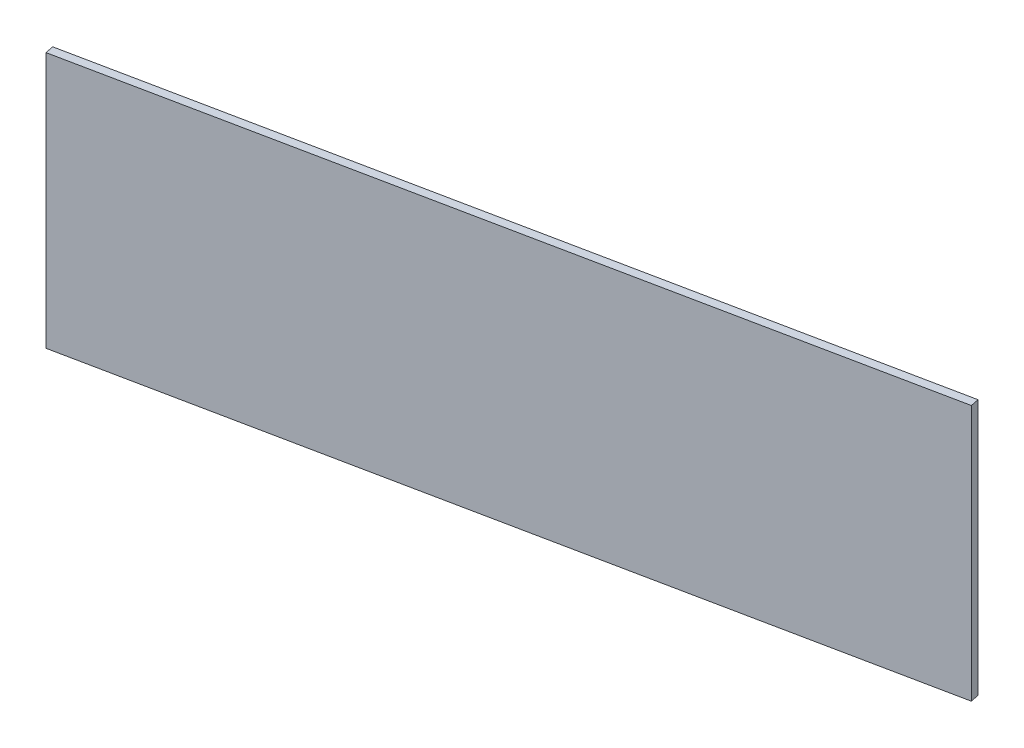
ISO-10303-21;
HEADER;
FILE_DESCRIPTION(('STEP AP214'),'2;1');
FILE_NAME('part.step','',(''),(''),'','','');
FILE_SCHEMA(('AUTOMOTIVE_DESIGN { 1 0 10303 214 1 1 1 1 }'));
ENDSEC;
DATA;
#1=APPLICATION_CONTEXT('core data for automotive mechanical design processes');
#2=APPLICATION_PROTOCOL_DEFINITION('international standard','automotive_design',2000,#1);
#3=PRODUCT_CONTEXT('',#1,'mechanical');
#4=PRODUCT('Part','Part','',(#3));
#5=PRODUCT_RELATED_PRODUCT_CATEGORY('part','',(#4));
#6=PRODUCT_DEFINITION_FORMATION('','',#4);
#7=PRODUCT_DEFINITION_CONTEXT('part definition',#1,'design');
#8=PRODUCT_DEFINITION('design','',#6,#7);
#9=PRODUCT_DEFINITION_SHAPE('','',#8);
#10=(LENGTH_UNIT() NAMED_UNIT(*) SI_UNIT(.MILLI.,.METRE.));
#11=(NAMED_UNIT(*) PLANE_ANGLE_UNIT() SI_UNIT($,.RADIAN.));
#12=(NAMED_UNIT(*) SI_UNIT($,.STERADIAN.) SOLID_ANGLE_UNIT());
#13=UNCERTAINTY_MEASURE_WITH_UNIT(LENGTH_MEASURE(1.E-05),#10,'distance_accuracy_value','');
#14=(GEOMETRIC_REPRESENTATION_CONTEXT(3) GLOBAL_UNCERTAINTY_ASSIGNED_CONTEXT((#13)) GLOBAL_UNIT_ASSIGNED_CONTEXT((#10,
#11,#12)) REPRESENTATION_CONTEXT('',''));
#15=CARTESIAN_POINT('',(0.,0.,0.));
#16=DIRECTION('',(0.,0.,1.));
#17=DIRECTION('',(1.,0.,0.));
#18=AXIS2_PLACEMENT_3D('',#15,#16,#17);
#19=CARTESIAN_POINT('',(0.320199529269978,0.,1.5663814810234));
#20=DIRECTION('',(-0.200278154070655,0.,-0.979739078021312));
#21=DIRECTION('',(-0.979739078021312,0.,0.200278154070655));
#22=AXIS2_PLACEMENT_3D('',#19,#20,#21);
#23=PLANE('',#22);
#24=DIRECTION('',(0.,-1.,0.));
#25=VECTOR('',#24,1.);
#26=CARTESIAN_POINT('',(0.602002781540707,0.29,1.5087752913327));
#27=LINE('',#26,#25);
#28=CARTESIAN_POINT('',(0.602002781540707,0.29,1.5087752913327));
#29=VERTEX_POINT('',#28);
#30=CARTESIAN_POINT('',(0.602002781540707,-0.01,1.5087752913327));
#31=VERTEX_POINT('',#30);
#32=EDGE_CURVE('E11',#29,#31,#27,.T.);
#33=ORIENTED_EDGE('',*,*,#32,.T.);
#34=DIRECTION('',(0.979739078021312,0.,-0.200278154070655));
#35=VECTOR('',#34,1.);
#36=CARTESIAN_POINT('',(0.602002781540707,-0.01,1.5087752913327));
#37=LINE('',#36,#35);
#38=CARTESIAN_POINT('',(1.50200278154071,-0.01,1.32479739078021));
#39=VERTEX_POINT('',#38);
#40=EDGE_CURVE('E75',#31,#39,#37,.T.);
#41=ORIENTED_EDGE('',*,*,#40,.T.);
#42=DIRECTION('',(0.,1.,0.));
#43=VECTOR('',#42,1.);
#44=CARTESIAN_POINT('',(1.50200278154071,-0.01,1.32479739078021));
#45=LINE('',#44,#43);
#46=CARTESIAN_POINT('',(1.50200278154071,0.29,1.32479739078021));
#47=VERTEX_POINT('',#46);
#48=EDGE_CURVE('E72',#39,#47,#45,.T.);
#49=ORIENTED_EDGE('',*,*,#48,.T.);
#50=DIRECTION('',(-0.979739078021312,0.,0.200278154070655));
#51=VECTOR('',#50,1.);
#52=CARTESIAN_POINT('',(1.50200278154071,0.29,1.32479739078021));
#53=LINE('',#52,#51);
#54=EDGE_CURVE('E65',#47,#29,#53,.T.);
#55=ORIENTED_EDGE('',*,*,#54,.T.);
#56=EDGE_LOOP('',(#33,#41,#49,#55));
#57=FACE_BOUND('',#56,.T.);
#58=ADVANCED_FACE('F17',(#57),#23,.F.);
#59=CARTESIAN_POINT('',(0.602002781540707,0.29,1.5087752913327));
#60=DIRECTION('',(0.,-1.,0.));
#61=DIRECTION('',(0.,0.,-1.));
#62=AXIS2_PLACEMENT_3D('',#59,#60,#61);
#63=PLANE('',#62);
#64=DIRECTION('',(-0.979739078021312,0.,0.200278154070655));
#65=VECTOR('',#64,1.);
#66=CARTESIAN_POINT('',(1.5,0.29,1.315));
#67=LINE('',#66,#65);
#68=CARTESIAN_POINT('',(1.5,0.29,1.315));
#69=VERTEX_POINT('',#68);
#70=CARTESIAN_POINT('',(0.600000000000001,0.29,1.49897790055249));
#71=VERTEX_POINT('',#70);
#72=EDGE_CURVE('E24',#69,#71,#67,.T.);
#73=ORIENTED_EDGE('',*,*,#72,.T.);
#74=DIRECTION('',(-0.200278154070647,0.,-0.979739078021314));
#75=VECTOR('',#74,1.);
#76=CARTESIAN_POINT('',(0.602002781540707,0.29,1.5087752913327));
#77=LINE('',#76,#75);
#78=EDGE_CURVE('E76',#29,#71,#77,.T.);
#79=ORIENTED_EDGE('',*,*,#78,.F.);
#80=ORIENTED_EDGE('',*,*,#54,.F.);
#81=DIRECTION('',(-0.200278154070649,0.,-0.979739078021313));
#82=VECTOR('',#81,1.);
#83=CARTESIAN_POINT('',(1.50200278154071,0.29,1.32479739078021));
#84=LINE('',#83,#82);
#85=EDGE_CURVE('E85',#47,#69,#84,.T.);
#86=ORIENTED_EDGE('',*,*,#85,.T.);
#87=EDGE_LOOP('',(#73,#79,#80,#86));
#88=FACE_BOUND('',#87,.T.);
#89=ADVANCED_FACE('F91',(#88),#63,.F.);
#90=CARTESIAN_POINT('',(1.50200278154071,-0.01,1.32479739078021));
#91=DIRECTION('',(-0.979739078021312,0.,0.200278154070655));
#92=DIRECTION('',(0.200278154070655,0.,0.979739078021312));
#93=AXIS2_PLACEMENT_3D('',#90,#91,#92);
#94=PLANE('',#93);
#95=DIRECTION('',(0.,-1.,0.));
#96=VECTOR('',#95,1.);
#97=CARTESIAN_POINT('',(1.5,0.29,1.315));
#98=LINE('',#97,#96);
#99=CARTESIAN_POINT('',(1.5,-0.01,1.315));
#100=VERTEX_POINT('',#99);
#101=EDGE_CURVE('E71',#69,#100,#98,.T.);
#102=ORIENTED_EDGE('',*,*,#101,.F.);
#103=ORIENTED_EDGE('',*,*,#85,.F.);
#104=ORIENTED_EDGE('',*,*,#48,.F.);
#105=DIRECTION('',(-0.200278154070649,0.,-0.979739078021313));
#106=VECTOR('',#105,1.);
#107=CARTESIAN_POINT('',(1.50200278154071,-0.01,1.32479739078021));
#108=LINE('',#107,#106);
#109=EDGE_CURVE('E61',#39,#100,#108,.T.);
#110=ORIENTED_EDGE('',*,*,#109,.T.);
#111=EDGE_LOOP('',(#102,#103,#104,#110));
#112=FACE_BOUND('',#111,.T.);
#113=ADVANCED_FACE('F69',(#112),#94,.F.);
#114=CARTESIAN_POINT('',(0.602002781540707,-0.01,1.5087752913327));
#115=DIRECTION('',(0.979739078021312,0.,-0.200278154070655));
#116=DIRECTION('',(-0.200278154070655,0.,-0.979739078021312));
#117=AXIS2_PLACEMENT_3D('',#114,#115,#116);
#118=PLANE('',#117);
#119=DIRECTION('',(0.,-1.,0.));
#120=VECTOR('',#119,1.);
#121=CARTESIAN_POINT('',(0.600000000000001,0.29,1.49897790055249));
#122=LINE('',#121,#120);
#123=CARTESIAN_POINT('',(0.600000000000001,-0.01,1.49897790055249));
#124=VERTEX_POINT('',#123);
#125=EDGE_CURVE('E83',#71,#124,#122,.T.);
#126=ORIENTED_EDGE('',*,*,#125,.T.);
#127=DIRECTION('',(-0.200278154070647,0.,-0.979739078021314));
#128=VECTOR('',#127,1.);
#129=CARTESIAN_POINT('',(0.602002781540707,-0.01,1.5087752913327));
#130=LINE('',#129,#128);
#131=EDGE_CURVE('E62',#31,#124,#130,.T.);
#132=ORIENTED_EDGE('',*,*,#131,.F.);
#133=ORIENTED_EDGE('',*,*,#32,.F.);
#134=ORIENTED_EDGE('',*,*,#78,.T.);
#135=EDGE_LOOP('',(#126,#132,#133,#134));
#136=FACE_BOUND('',#135,.T.);
#137=ADVANCED_FACE('F90',(#136),#118,.F.);
#138=CARTESIAN_POINT('',(0.,-0.01,0.));
#139=DIRECTION('',(0.,-1.,0.));
#140=DIRECTION('',(0.,0.,-1.));
#141=AXIS2_PLACEMENT_3D('',#138,#139,#140);
#142=PLANE('',#141);
#143=DIRECTION('',(-0.979739078021312,0.,0.200278154070655));
#144=VECTOR('',#143,1.);
#145=CARTESIAN_POINT('',(1.5,-0.00999999999999999,1.315));
#146=LINE('',#145,#144);
#147=EDGE_CURVE('E57',#100,#124,#146,.T.);
#148=ORIENTED_EDGE('',*,*,#147,.F.);
#149=ORIENTED_EDGE('',*,*,#109,.F.);
#150=ORIENTED_EDGE('',*,*,#40,.F.);
#151=ORIENTED_EDGE('',*,*,#131,.T.);
#152=EDGE_LOOP('',(#148,#149,#150,#151));
#153=FACE_BOUND('',#152,.T.);
#154=ADVANCED_FACE('F59',(#153),#142,.T.);
#155=CARTESIAN_POINT('',(0.600000000000001,0.29,1.49897790055249));
#156=DIRECTION('',(-0.200278154070656,0.,-0.979739078021312));
#157=DIRECTION('',(0.979739078021312,0.,-0.200278154070656));
#158=AXIS2_PLACEMENT_3D('',#155,#156,#157);
#159=PLANE('',#158);
#160=ORIENTED_EDGE('',*,*,#147,.T.);
#161=ORIENTED_EDGE('',*,*,#125,.F.);
#162=ORIENTED_EDGE('',*,*,#72,.F.);
#163=ORIENTED_EDGE('',*,*,#101,.T.);
#164=EDGE_LOOP('',(#160,#161,#162,#163));
#165=FACE_BOUND('',#164,.T.);
#166=ADVANCED_FACE('F74',(#165),#159,.T.);
#167=CLOSED_SHELL('',(#58,#89,#113,#137,#154,#166));
#168=MANIFOLD_SOLID_BREP('B1',#167);
#169=ADVANCED_BREP_SHAPE_REPRESENTATION('',(#18,#168),#14);
#170=SHAPE_DEFINITION_REPRESENTATION(#9,#169);
ENDSEC;
END-ISO-10303-21;
